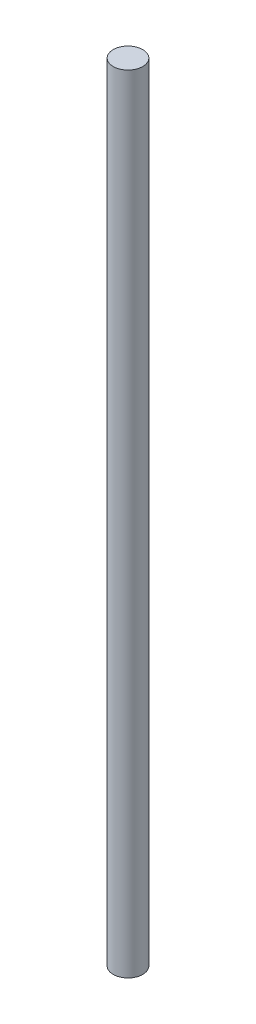
ISO-10303-21;
HEADER;
FILE_DESCRIPTION(('STEP AP214'),'2;1');
FILE_NAME('part.step','',(''),(''),'','','');
FILE_SCHEMA(('AUTOMOTIVE_DESIGN { 1 0 10303 214 1 1 1 1 }'));
ENDSEC;
DATA;
#1=APPLICATION_CONTEXT('core data for automotive mechanical design processes');
#2=APPLICATION_PROTOCOL_DEFINITION('international standard','automotive_design',2000,#1);
#3=PRODUCT_CONTEXT('',#1,'mechanical');
#4=PRODUCT('Part','Part','',(#3));
#5=PRODUCT_RELATED_PRODUCT_CATEGORY('part','',(#4));
#6=PRODUCT_DEFINITION_FORMATION('','',#4);
#7=PRODUCT_DEFINITION_CONTEXT('part definition',#1,'design');
#8=PRODUCT_DEFINITION('design','',#6,#7);
#9=PRODUCT_DEFINITION_SHAPE('','',#8);
#10=(LENGTH_UNIT() NAMED_UNIT(*) SI_UNIT(.MILLI.,.METRE.));
#11=(NAMED_UNIT(*) PLANE_ANGLE_UNIT() SI_UNIT($,.RADIAN.));
#12=(NAMED_UNIT(*) SI_UNIT($,.STERADIAN.) SOLID_ANGLE_UNIT());
#13=UNCERTAINTY_MEASURE_WITH_UNIT(LENGTH_MEASURE(1.E-05),#10,'distance_accuracy_value','');
#14=(GEOMETRIC_REPRESENTATION_CONTEXT(3) GLOBAL_UNCERTAINTY_ASSIGNED_CONTEXT((#13)) GLOBAL_UNIT_ASSIGNED_CONTEXT((#10,
#11,#12)) REPRESENTATION_CONTEXT('',''));
#15=CARTESIAN_POINT('',(0.,0.,0.));
#16=DIRECTION('',(0.,0.,1.));
#17=DIRECTION('',(1.,0.,0.));
#18=AXIS2_PLACEMENT_3D('',#15,#16,#17);
#19=CARTESIAN_POINT('',(0.,127.,0.));
#20=DIRECTION('',(0.,-1.,0.));
#21=DIRECTION('',(0.,0.,-1.));
#22=AXIS2_PLACEMENT_3D('',#19,#20,#21);
#23=CYLINDRICAL_SURFACE('',#22,2.38125);
#24=CARTESIAN_POINT('',(0.,127.,0.));
#25=DIRECTION('',(0.,1.,0.));
#26=DIRECTION('',(0.,0.,1.));
#27=AXIS2_PLACEMENT_3D('',#24,#25,#26);
#28=CIRCLE('',#27,2.38125);
#29=CARTESIAN_POINT('',(0.,127.,2.38125));
#30=VERTEX_POINT('',#29);
#31=EDGE_CURVE('E10',#30,#30,#28,.T.);
#32=ORIENTED_EDGE('',*,*,#31,.F.);
#33=EDGE_LOOP('',(#32));
#34=FACE_BOUND('',#33,.T.);
#35=CARTESIAN_POINT('',(0.,0.,0.));
#36=DIRECTION('',(0.,1.,0.));
#37=DIRECTION('',(0.,0.,1.));
#38=AXIS2_PLACEMENT_3D('',#35,#36,#37);
#39=CIRCLE('',#38,2.38125);
#40=CARTESIAN_POINT('',(0.,0.,2.38125));
#41=VERTEX_POINT('',#40);
#42=EDGE_CURVE('E34',#41,#41,#39,.T.);
#43=ORIENTED_EDGE('',*,*,#42,.T.);
#44=EDGE_LOOP('',(#43));
#45=FACE_BOUND('',#44,.T.);
#46=ADVANCED_FACE('F31',(#34,#45),#23,.T.);
#47=CARTESIAN_POINT('',(0.,127.,0.));
#48=DIRECTION('',(0.,1.,0.));
#49=DIRECTION('',(0.,0.,1.));
#50=AXIS2_PLACEMENT_3D('',#47,#48,#49);
#51=PLANE('',#50);
#52=ORIENTED_EDGE('',*,*,#31,.T.);
#53=EDGE_LOOP('',(#52));
#54=FACE_BOUND('',#53,.T.);
#55=ADVANCED_FACE('F46',(#54),#51,.T.);
#56=CARTESIAN_POINT('',(0.,0.,0.));
#57=DIRECTION('',(0.,1.,0.));
#58=DIRECTION('',(0.,0.,1.));
#59=AXIS2_PLACEMENT_3D('',#56,#57,#58);
#60=PLANE('',#59);
#61=ORIENTED_EDGE('',*,*,#42,.F.);
#62=EDGE_LOOP('',(#61));
#63=FACE_BOUND('',#62,.T.);
#64=ADVANCED_FACE('F44',(#63),#60,.F.);
#65=CLOSED_SHELL('',(#46,#55,#64));
#66=MANIFOLD_SOLID_BREP('B2',#65);
#67=ADVANCED_BREP_SHAPE_REPRESENTATION('',(#18,#66),#14);
#68=SHAPE_DEFINITION_REPRESENTATION(#9,#67);
ENDSEC;
END-ISO-10303-21;
